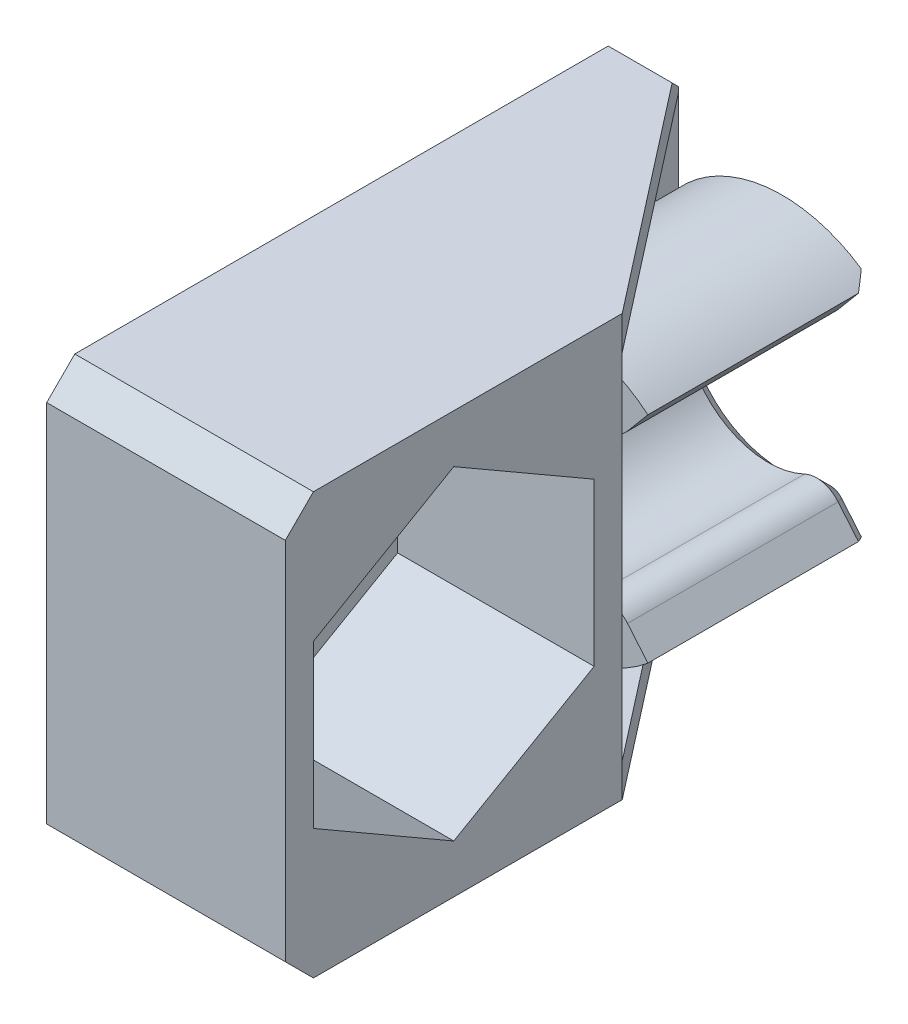
ISO-10303-21;
HEADER;
FILE_DESCRIPTION(('STEP AP214'),'2;1');
FILE_NAME('part.step','',(''),(''),'','','');
FILE_SCHEMA(('AUTOMOTIVE_DESIGN { 1 0 10303 214 1 1 1 1 }'));
ENDSEC;
DATA;
#1=APPLICATION_CONTEXT('core data for automotive mechanical design processes');
#2=APPLICATION_PROTOCOL_DEFINITION('international standard','automotive_design',2000,#1);
#3=PRODUCT_CONTEXT('',#1,'mechanical');
#4=PRODUCT('Part','Part','',(#3));
#5=PRODUCT_RELATED_PRODUCT_CATEGORY('part','',(#4));
#6=PRODUCT_DEFINITION_FORMATION('','',#4);
#7=PRODUCT_DEFINITION_CONTEXT('part definition',#1,'design');
#8=PRODUCT_DEFINITION('design','',#6,#7);
#9=PRODUCT_DEFINITION_SHAPE('','',#8);
#10=(LENGTH_UNIT() NAMED_UNIT(*) SI_UNIT(.MILLI.,.METRE.));
#11=(NAMED_UNIT(*) PLANE_ANGLE_UNIT() SI_UNIT($,.RADIAN.));
#12=(NAMED_UNIT(*) SI_UNIT($,.STERADIAN.) SOLID_ANGLE_UNIT());
#13=UNCERTAINTY_MEASURE_WITH_UNIT(LENGTH_MEASURE(1.E-05),#10,'distance_accuracy_value','');
#14=(GEOMETRIC_REPRESENTATION_CONTEXT(3) GLOBAL_UNCERTAINTY_ASSIGNED_CONTEXT((#13)) GLOBAL_UNIT_ASSIGNED_CONTEXT((#10,
#11,#12)) REPRESENTATION_CONTEXT('',''));
#15=CARTESIAN_POINT('',(0.,0.,0.));
#16=DIRECTION('',(0.,0.,1.));
#17=DIRECTION('',(1.,0.,0.));
#18=AXIS2_PLACEMENT_3D('',#15,#16,#17);
#19=CARTESIAN_POINT('',(-3.7,0.,0.));
#20=DIRECTION('',(-1.,0.,0.));
#21=DIRECTION('',(0.,0.,1.));
#22=AXIS2_PLACEMENT_3D('',#19,#20,#21);
#23=PLANE('',#22);
#24=DIRECTION('',(0.,0.,1.));
#25=VECTOR('',#24,1.);
#26=CARTESIAN_POINT('',(-3.7,-6.3,9.));
#27=LINE('',#26,#25);
#28=CARTESIAN_POINT('',(-3.7,-6.3,0.));
#29=VERTEX_POINT('',#28);
#30=CARTESIAN_POINT('',(-3.7,-6.3,9.));
#31=VERTEX_POINT('',#30);
#32=EDGE_CURVE('E229',#29,#31,#27,.T.);
#33=ORIENTED_EDGE('',*,*,#32,.F.);
#34=DIRECTION('',(0.,-1.,0.));
#35=VECTOR('',#34,1.);
#36=CARTESIAN_POINT('',(-3.7,7.5,0.));
#37=LINE('',#36,#35);
#38=CARTESIAN_POINT('',(-3.7,-3.36303434416005,0.));
#39=VERTEX_POINT('',#38);
#40=EDGE_CURVE('E246',#39,#29,#37,.T.);
#41=ORIENTED_EDGE('',*,*,#40,.F.);
#42=DIRECTION('',(0.,0.,-1.));
#43=VECTOR('',#42,1.);
#44=CARTESIAN_POINT('',(-3.7,-3.36303434416005,8.));
#45=LINE('',#44,#43);
#46=CARTESIAN_POINT('',(-3.7,-3.36303434416005,8.));
#47=VERTEX_POINT('',#46);
#48=EDGE_CURVE('E266',#39,#47,#45,.F.);
#49=ORIENTED_EDGE('',*,*,#48,.T.);
#50=DIRECTION('',(0.,-1.,0.));
#51=VECTOR('',#50,1.);
#52=CARTESIAN_POINT('',(-3.7,0.,8.));
#53=LINE('',#52,#51);
#54=CARTESIAN_POINT('',(-3.7,3.36303434416005,8.));
#55=VERTEX_POINT('',#54);
#56=EDGE_CURVE('E264',#55,#47,#53,.T.);
#57=ORIENTED_EDGE('',*,*,#56,.F.);
#58=DIRECTION('',(0.,0.,-1.));
#59=VECTOR('',#58,1.);
#60=CARTESIAN_POINT('',(-3.7,3.36303434416005,8.));
#61=LINE('',#60,#59);
#62=CARTESIAN_POINT('',(-3.7,3.36303434416005,0.));
#63=VERTEX_POINT('',#62);
#64=EDGE_CURVE('E272',#55,#63,#61,.T.);
#65=ORIENTED_EDGE('',*,*,#64,.T.);
#66=CARTESIAN_POINT('',(-3.7,6.3,0.));
#67=VERTEX_POINT('',#66);
#68=EDGE_CURVE('E255',#67,#63,#37,.T.);
#69=ORIENTED_EDGE('',*,*,#68,.F.);
#70=DIRECTION('',(0.,0.,1.));
#71=VECTOR('',#70,1.);
#72=CARTESIAN_POINT('',(-3.7,6.3,9.));
#73=LINE('',#72,#71);
#74=CARTESIAN_POINT('',(-3.7,6.3,9.));
#75=VERTEX_POINT('',#74);
#76=EDGE_CURVE('E408',#67,#75,#73,.T.);
#77=ORIENTED_EDGE('',*,*,#76,.T.);
#78=DIRECTION('',(0.,1.,0.));
#79=VECTOR('',#78,1.);
#80=CARTESIAN_POINT('',(-3.7,7.5,9.));
#81=LINE('',#80,#79);
#82=EDGE_CURVE('E248',#31,#75,#81,.T.);
#83=ORIENTED_EDGE('',*,*,#82,.F.);
#84=EDGE_LOOP('',(#33,#41,#49,#57,#65,#69,#77,#83));
#85=FACE_BOUND('',#84,.T.);
#86=ADVANCED_FACE('F34',(#85),#23,.F.);
#87=CARTESIAN_POINT('',(3.3,7.5,9.));
#88=DIRECTION('',(0.,0.,1.));
#89=DIRECTION('',(1.,0.,0.));
#90=AXIS2_PLACEMENT_3D('',#87,#88,#89);
#91=PLANE('',#90);
#92=DIRECTION('',(1.,0.,0.));
#93=VECTOR('',#92,1.);
#94=CARTESIAN_POINT('',(3.3,-6.3,9.));
#95=LINE('',#94,#93);
#96=CARTESIAN_POINT('',(3.3,-6.3,9.));
#97=VERTEX_POINT('',#96);
#98=EDGE_CURVE('E231',#31,#97,#95,.T.);
#99=ORIENTED_EDGE('',*,*,#98,.F.);
#100=ORIENTED_EDGE('',*,*,#82,.T.);
#101=DIRECTION('',(1.,0.,0.));
#102=VECTOR('',#101,1.);
#103=CARTESIAN_POINT('',(3.3,6.3,9.));
#104=LINE('',#103,#102);
#105=CARTESIAN_POINT('',(3.3,6.3,9.));
#106=VERTEX_POINT('',#105);
#107=EDGE_CURVE('E410',#75,#106,#104,.T.);
#108=ORIENTED_EDGE('',*,*,#107,.T.);
#109=DIRECTION('',(0.,1.,0.));
#110=VECTOR('',#109,1.);
#111=CARTESIAN_POINT('',(3.3,7.5,9.));
#112=LINE('',#111,#110);
#113=EDGE_CURVE('E468',#97,#106,#112,.T.);
#114=ORIENTED_EDGE('',*,*,#113,.F.);
#115=EDGE_LOOP('',(#99,#100,#108,#114));
#116=FACE_BOUND('',#115,.T.);
#117=ADVANCED_FACE('F570',(#116),#91,.F.);
#118=CARTESIAN_POINT('',(0.,0.,8.));
#119=DIRECTION('',(0.,0.,-1.));
#120=DIRECTION('',(-1.,0.,0.));
#121=AXIS2_PLACEMENT_3D('',#118,#119,#120);
#122=CYLINDRICAL_SURFACE('',#121,5.);
#123=DIRECTION('',(0.,0.,-1.));
#124=VECTOR('',#123,1.);
#125=CARTESIAN_POINT('',(3.21393804843269,3.8302222155949,8.));
#126=LINE('',#125,#124);
#127=CARTESIAN_POINT('',(3.21393804843269,3.8302222155949,8.));
#128=VERTEX_POINT('',#127);
#129=CARTESIAN_POINT('',(3.21393804843269,3.8302222155949,0.500000000000002));
#130=VERTEX_POINT('',#129);
#131=EDGE_CURVE('E300',#128,#130,#126,.T.);
#132=ORIENTED_EDGE('',*,*,#131,.T.);
#133=CARTESIAN_POINT('',(0.,0.,0.500000000000002));
#134=DIRECTION('',(-0.5416752204197,0.454519477672041,0.707106781186551));
#135=DIRECTION('',(-0.541675220419705,0.454519477672045,-0.707106781186544));
#136=AXIS2_PLACEMENT_3D('',#133,#134,#135);
#137=ELLIPSE('',#136,7.07106781186544,5.);
#138=CARTESIAN_POINT('',(2.81480576027,4.13241679068688,0.));
#139=VERTEX_POINT('',#138);
#140=EDGE_CURVE('E338',#130,#139,#137,.T.);
#141=ORIENTED_EDGE('',*,*,#140,.T.);
#142=CARTESIAN_POINT('',(0.,0.,0.));
#143=DIRECTION('',(0.,0.,1.));
#144=DIRECTION('',(1.,0.,0.));
#145=AXIS2_PLACEMENT_3D('',#142,#143,#144);
#146=CIRCLE('',#145,5.);
#147=EDGE_CURVE('E278',#139,#63,#146,.T.);
#148=ORIENTED_EDGE('',*,*,#147,.T.);
#149=ORIENTED_EDGE('',*,*,#64,.F.);
#150=CARTESIAN_POINT('',(0.,0.,8.));
#151=DIRECTION('',(0.,0.,1.));
#152=DIRECTION('',(1.,0.,0.));
#153=AXIS2_PLACEMENT_3D('',#150,#151,#152);
#154=CIRCLE('',#153,5.);
#155=EDGE_CURVE('E284',#128,#55,#154,.T.);
#156=ORIENTED_EDGE('',*,*,#155,.F.);
#157=EDGE_LOOP('',(#132,#141,#148,#149,#156));
#158=FACE_BOUND('',#157,.T.);
#159=ADVANCED_FACE('F508',(#158),#122,.T.);
#160=CARTESIAN_POINT('',(0.,0.,8.));
#161=DIRECTION('',(0.,0.,-1.));
#162=DIRECTION('',(-1.,0.,0.));
#163=AXIS2_PLACEMENT_3D('',#160,#161,#162);
#164=CYLINDRICAL_SURFACE('',#163,5.);
#165=CARTESIAN_POINT('',(0.,0.,0.));
#166=DIRECTION('',(0.,0.,1.));
#167=DIRECTION('',(1.,0.,0.));
#168=AXIS2_PLACEMENT_3D('',#165,#166,#167);
#169=CIRCLE('',#168,5.);
#170=CARTESIAN_POINT('',(2.81480576027,-4.13241679068688,0.));
#171=VERTEX_POINT('',#170);
#172=EDGE_CURVE('E254',#39,#171,#169,.T.);
#173=ORIENTED_EDGE('',*,*,#172,.T.);
#174=CARTESIAN_POINT('',(0.,0.,0.500000000000002));
#175=DIRECTION('',(-0.5416752204197,-0.454519477672041,0.707106781186551));
#176=DIRECTION('',(-0.541675220419705,-0.454519477672045,-0.707106781186544));
#177=AXIS2_PLACEMENT_3D('',#174,#175,#176);
#178=ELLIPSE('',#177,7.07106781186544,5.);
#179=CARTESIAN_POINT('',(3.21393804843269,-3.8302222155949,0.500000000000002));
#180=VERTEX_POINT('',#179);
#181=EDGE_CURVE('E334',#171,#180,#178,.T.);
#182=ORIENTED_EDGE('',*,*,#181,.T.);
#183=DIRECTION('',(0.,0.,-1.));
#184=VECTOR('',#183,1.);
#185=CARTESIAN_POINT('',(3.21393804843269,-3.8302222155949,8.));
#186=LINE('',#185,#184);
#187=CARTESIAN_POINT('',(3.21393804843269,-3.8302222155949,8.));
#188=VERTEX_POINT('',#187);
#189=EDGE_CURVE('E291',#188,#180,#186,.T.);
#190=ORIENTED_EDGE('',*,*,#189,.F.);
#191=CARTESIAN_POINT('',(0.,0.,8.));
#192=DIRECTION('',(0.,0.,1.));
#193=DIRECTION('',(1.,0.,0.));
#194=AXIS2_PLACEMENT_3D('',#191,#192,#193);
#195=CIRCLE('',#194,5.);
#196=EDGE_CURVE('E286',#47,#188,#195,.T.);
#197=ORIENTED_EDGE('',*,*,#196,.F.);
#198=ORIENTED_EDGE('',*,*,#48,.F.);
#199=EDGE_LOOP('',(#173,#182,#190,#197,#198));
#200=FACE_BOUND('',#199,.T.);
#201=ADVANCED_FACE('F538',(#200),#164,.T.);
#202=CARTESIAN_POINT('',(0.,0.,8.));
#203=DIRECTION('',(0.,0.,1.));
#204=DIRECTION('',(1.,0.,0.));
#205=AXIS2_PLACEMENT_3D('',#202,#203,#204);
#206=PLANE('',#205);
#207=DIRECTION('',(-0.642787609686538,0.766044443118979,0.));
#208=VECTOR('',#207,1.);
#209=CARTESIAN_POINT('',(1.92836282905961,-2.29813332935694,8.));
#210=LINE('',#209,#208);
#211=CARTESIAN_POINT('',(2.48950570746443,-2.96687737065454,8.));
#212=VERTEX_POINT('',#211);
#213=EDGE_CURVE('E288',#188,#212,#210,.T.);
#214=ORIENTED_EDGE('',*,*,#213,.T.);
#215=CARTESIAN_POINT('',(1.72346126434545,-3.60966498034108,8.));
#216=DIRECTION('',(0.,0.,1.));
#217=DIRECTION('',(1.,0.,0.));
#218=AXIS2_PLACEMENT_3D('',#215,#216,#217);
#219=CIRCLE('',#218,1.);
#220=CARTESIAN_POINT('',(1.29259594825909,-2.70724873525581,8.));
#221=VERTEX_POINT('',#220);
#222=EDGE_CURVE('E316',#212,#221,#219,.T.);
#223=ORIENTED_EDGE('',*,*,#222,.T.);
#224=CARTESIAN_POINT('',(0.,0.,8.));
#225=DIRECTION('',(0.,0.,-1.));
#226=DIRECTION('',(1.,0.,0.));
#227=AXIS2_PLACEMENT_3D('',#224,#225,#226);
#228=CIRCLE('',#227,3.);
#229=CARTESIAN_POINT('',(1.29259594825909,2.70724873525581,8.));
#230=VERTEX_POINT('',#229);
#231=EDGE_CURVE('E279',#221,#230,#228,.T.);
#232=ORIENTED_EDGE('',*,*,#231,.T.);
#233=CARTESIAN_POINT('',(1.72346126434546,3.60966498034108,8.));
#234=DIRECTION('',(0.,0.,1.));
#235=DIRECTION('',(1.,0.,0.));
#236=AXIS2_PLACEMENT_3D('',#233,#234,#235);
#237=CIRCLE('',#236,1.);
#238=CARTESIAN_POINT('',(2.48950570746443,2.96687737065454,8.));
#239=VERTEX_POINT('',#238);
#240=EDGE_CURVE('E314',#230,#239,#237,.T.);
#241=ORIENTED_EDGE('',*,*,#240,.T.);
#242=DIRECTION('',(0.642787609686538,0.766044443118979,0.));
#243=VECTOR('',#242,1.);
#244=CARTESIAN_POINT('',(1.92836282905961,2.29813332935694,8.));
#245=LINE('',#244,#243);
#246=EDGE_CURVE('E282',#239,#128,#245,.T.);
#247=ORIENTED_EDGE('',*,*,#246,.T.);
#248=ORIENTED_EDGE('',*,*,#155,.T.);
#249=ORIENTED_EDGE('',*,*,#56,.T.);
#250=ORIENTED_EDGE('',*,*,#196,.T.);
#251=EDGE_LOOP('',(#214,#223,#232,#241,#247,#248,#249,#250));
#252=FACE_BOUND('',#251,.T.);
#253=ADVANCED_FACE('F544',(#252),#206,.T.);
#254=CARTESIAN_POINT('',(0.,0.,8.));
#255=DIRECTION('',(0.,0.,-1.));
#256=DIRECTION('',(-1.,0.,0.));
#257=AXIS2_PLACEMENT_3D('',#254,#255,#256);
#258=CYLINDRICAL_SURFACE('',#257,3.);
#259=DIRECTION('',(0.,0.,-1.));
#260=VECTOR('',#259,1.);
#261=CARTESIAN_POINT('',(1.29259594825909,-2.70724873525581,8.));
#262=LINE('',#261,#260);
#263=CARTESIAN_POINT('',(1.29259594825909,-2.70724873525581,0.500000000000002));
#264=VERTEX_POINT('',#263);
#265=EDGE_CURVE('E309',#221,#264,#262,.T.);
#266=ORIENTED_EDGE('',*,*,#265,.T.);
#267=CARTESIAN_POINT('',(0.,0.,0.500000000000002));
#268=DIRECTION('',(0.,0.,1.));
#269=DIRECTION('',(1.,0.,0.));
#270=AXIS2_PLACEMENT_3D('',#267,#268,#269);
#271=CIRCLE('',#270,3.);
#272=CARTESIAN_POINT('',(1.29259594825909,2.70724873525581,0.500000000000002));
#273=VERTEX_POINT('',#272);
#274=EDGE_CURVE('E344',#264,#273,#271,.F.);
#275=ORIENTED_EDGE('',*,*,#274,.T.);
#276=DIRECTION('',(0.,0.,-1.));
#277=VECTOR('',#276,1.);
#278=CARTESIAN_POINT('',(1.29259594825909,2.70724873525581,8.));
#279=LINE('',#278,#277);
#280=EDGE_CURVE('E303',#273,#230,#279,.F.);
#281=ORIENTED_EDGE('',*,*,#280,.T.);
#282=ORIENTED_EDGE('',*,*,#231,.F.);
#283=EDGE_LOOP('',(#266,#275,#281,#282));
#284=FACE_BOUND('',#283,.T.);
#285=ADVANCED_FACE('F550',(#284),#258,.F.);
#286=CARTESIAN_POINT('',(1.92836282905961,2.29813332935694,8.));
#287=DIRECTION('',(-0.766044443118979,0.642787609686538,0.));
#288=DIRECTION('',(-0.642787609686538,-0.766044443118979,0.));
#289=AXIS2_PLACEMENT_3D('',#286,#287,#288);
#290=PLANE('',#289);
#291=DIRECTION('',(0.,0.,-1.));
#292=VECTOR('',#291,1.);
#293=CARTESIAN_POINT('',(2.48950570746443,2.96687737065454,8.));
#294=LINE('',#293,#292);
#295=CARTESIAN_POINT('',(2.48950570746443,2.96687737065454,0.500000000000002));
#296=VERTEX_POINT('',#295);
#297=EDGE_CURVE('E318',#239,#296,#294,.T.);
#298=ORIENTED_EDGE('',*,*,#297,.T.);
#299=DIRECTION('',(0.642787609686538,0.766044443118979,0.));
#300=VECTOR('',#299,1.);
#301=CARTESIAN_POINT('',(1.92836282905961,2.29813332935694,0.500000000000002));
#302=LINE('',#301,#300);
#303=EDGE_CURVE('E336',#296,#130,#302,.T.);
#304=ORIENTED_EDGE('',*,*,#303,.T.);
#305=ORIENTED_EDGE('',*,*,#131,.F.);
#306=ORIENTED_EDGE('',*,*,#246,.F.);
#307=EDGE_LOOP('',(#298,#304,#305,#306));
#308=FACE_BOUND('',#307,.T.);
#309=ADVANCED_FACE('F558',(#308),#290,.F.);
#310=CARTESIAN_POINT('',(-5.2,2.5,8.));
#311=DIRECTION('',(1.,0.,0.));
#312=DIRECTION('',(0.,0.,-1.));
#313=AXIS2_PLACEMENT_3D('',#310,#311,#312);
#314=PLANE('',#313);
#315=CARTESIAN_POINT('',(-5.2,0.,15.));
#316=DIRECTION('',(-1.,0.,0.));
#317=DIRECTION('',(0.,0.,1.));
#318=AXIS2_PLACEMENT_3D('',#315,#316,#317);
#319=CIRCLE('',#318,3.);
#320=CARTESIAN_POINT('',(-5.2,0.,18.));
#321=VERTEX_POINT('',#320);
#322=EDGE_CURVE('E473',#321,#321,#319,.T.);
#323=ORIENTED_EDGE('',*,*,#322,.F.);
#324=EDGE_LOOP('',(#323));
#325=FACE_BOUND('',#324,.T.);
#326=DIRECTION('',(0.,1.,0.));
#327=VECTOR('',#326,1.);
#328=CARTESIAN_POINT('',(-5.2,7.5,21.));
#329=LINE('',#328,#327);
#330=CARTESIAN_POINT('',(-5.2,-6.49999999999999,21.));
#331=VERTEX_POINT('',#330);
#332=CARTESIAN_POINT('',(-5.2,6.5,21.));
#333=VERTEX_POINT('',#332);
#334=EDGE_CURVE('E260',#331,#333,#329,.T.);
#335=ORIENTED_EDGE('',*,*,#334,.T.);
#336=DIRECTION('',(0.,-0.707106781186546,0.707106781186549));
#337=VECTOR('',#336,1.);
#338=CARTESIAN_POINT('',(-5.2,6.5,21.));
#339=LINE('',#338,#337);
#340=CARTESIAN_POINT('',(-5.2,7.5,20.));
#341=VERTEX_POINT('',#340);
#342=EDGE_CURVE('E370',#333,#341,#339,.F.);
#343=ORIENTED_EDGE('',*,*,#342,.T.);
#344=DIRECTION('',(0.,0.,-1.));
#345=VECTOR('',#344,1.);
#346=CARTESIAN_POINT('',(-5.2,7.5,0.));
#347=LINE('',#346,#345);
#348=CARTESIAN_POINT('',(-5.2,7.5,1.));
#349=VERTEX_POINT('',#348);
#350=EDGE_CURVE('E256',#341,#349,#347,.T.);
#351=ORIENTED_EDGE('',*,*,#350,.T.);
#352=DIRECTION('',(0.,-0.707106781186549,-0.707106781186546));
#353=VECTOR('',#352,1.);
#354=CARTESIAN_POINT('',(-5.2,7.5,1.));
#355=LINE('',#354,#353);
#356=CARTESIAN_POINT('',(-5.2,6.5,0.));
#357=VERTEX_POINT('',#356);
#358=EDGE_CURVE('E364',#349,#357,#355,.T.);
#359=ORIENTED_EDGE('',*,*,#358,.T.);
#360=DIRECTION('',(0.,-1.,0.));
#361=VECTOR('',#360,1.);
#362=CARTESIAN_POINT('',(-5.2,2.5,0.));
#363=LINE('',#362,#361);
#364=CARTESIAN_POINT('',(-5.2,-6.5,0.));
#365=VERTEX_POINT('',#364);
#366=EDGE_CURVE('E294',#357,#365,#363,.T.);
#367=ORIENTED_EDGE('',*,*,#366,.T.);
#368=DIRECTION('',(0.,-0.707106781186546,0.707106781186549));
#369=VECTOR('',#368,1.);
#370=CARTESIAN_POINT('',(-5.2,-6.5,0.));
#371=LINE('',#370,#369);
#372=CARTESIAN_POINT('',(-5.2,-7.5,1.));
#373=VERTEX_POINT('',#372);
#374=EDGE_CURVE('E366',#365,#373,#371,.T.);
#375=ORIENTED_EDGE('',*,*,#374,.T.);
#376=DIRECTION('',(0.,0.,1.));
#377=VECTOR('',#376,1.);
#378=CARTESIAN_POINT('',(-5.2,-7.5,0.));
#379=LINE('',#378,#377);
#380=CARTESIAN_POINT('',(-5.2,-7.5,20.));
#381=VERTEX_POINT('',#380);
#382=EDGE_CURVE('E475',#373,#381,#379,.T.);
#383=ORIENTED_EDGE('',*,*,#382,.T.);
#384=DIRECTION('',(0.,-0.707106781186549,-0.707106781186546));
#385=VECTOR('',#384,1.);
#386=CARTESIAN_POINT('',(-5.2,-7.5,20.));
#387=LINE('',#386,#385);
#388=EDGE_CURVE('E368',#381,#331,#387,.F.);
#389=ORIENTED_EDGE('',*,*,#388,.T.);
#390=EDGE_LOOP('',(#335,#343,#351,#359,#367,#375,#383,#389));
#391=FACE_BOUND('',#390,.T.);
#392=ADVANCED_FACE('F391',(#325,#391),#314,.F.);
#393=CARTESIAN_POINT('',(1.92836282905961,-2.29813332935694,8.));
#394=DIRECTION('',(-0.766044443118979,-0.642787609686538,0.));
#395=DIRECTION('',(0.642787609686538,-0.766044443118979,0.));
#396=AXIS2_PLACEMENT_3D('',#393,#394,#395);
#397=PLANE('',#396);
#398=ORIENTED_EDGE('',*,*,#189,.T.);
#399=DIRECTION('',(-0.642787609686538,0.766044443118979,0.));
#400=VECTOR('',#399,1.);
#401=CARTESIAN_POINT('',(1.92836282905961,-2.29813332935694,0.500000000000002));
#402=LINE('',#401,#400);
#403=CARTESIAN_POINT('',(2.48950570746443,-2.96687737065454,0.500000000000002));
#404=VERTEX_POINT('',#403);
#405=EDGE_CURVE('E321',#180,#404,#402,.T.);
#406=ORIENTED_EDGE('',*,*,#405,.T.);
#407=DIRECTION('',(0.,0.,-1.));
#408=VECTOR('',#407,1.);
#409=CARTESIAN_POINT('',(2.48950570746443,-2.96687737065454,8.));
#410=LINE('',#409,#408);
#411=EDGE_CURVE('E312',#404,#212,#410,.F.);
#412=ORIENTED_EDGE('',*,*,#411,.T.);
#413=ORIENTED_EDGE('',*,*,#213,.F.);
#414=EDGE_LOOP('',(#398,#406,#412,#413));
#415=FACE_BOUND('',#414,.T.);
#416=ADVANCED_FACE('F541',(#415),#397,.F.);
#417=CARTESIAN_POINT('',(0.,0.,0.));
#418=DIRECTION('',(0.,0.,1.));
#419=DIRECTION('',(1.,0.,0.));
#420=AXIS2_PLACEMENT_3D('',#417,#418,#419);
#421=PLANE('',#420);
#422=DIRECTION('',(0.,-1.,0.));
#423=VECTOR('',#422,1.);
#424=CARTESIAN_POINT('',(-3.7,-6.3,0.));
#425=LINE('',#424,#423);
#426=CARTESIAN_POINT('',(-3.7,-6.5,0.));
#427=VERTEX_POINT('',#426);
#428=EDGE_CURVE('E235',#29,#427,#425,.T.);
#429=ORIENTED_EDGE('',*,*,#428,.T.);
#430=DIRECTION('',(-1.,0.,0.));
#431=VECTOR('',#430,1.);
#432=CARTESIAN_POINT('',(-5.2,-6.5,0.));
#433=LINE('',#432,#431);
#434=EDGE_CURVE('E387',#427,#365,#433,.T.);
#435=ORIENTED_EDGE('',*,*,#434,.T.);
#436=ORIENTED_EDGE('',*,*,#366,.F.);
#437=DIRECTION('',(1.,0.,0.));
#438=VECTOR('',#437,1.);
#439=CARTESIAN_POINT('',(-3.7,6.5,0.));
#440=LINE('',#439,#438);
#441=CARTESIAN_POINT('',(-3.7,6.5,0.));
#442=VERTEX_POINT('',#441);
#443=EDGE_CURVE('E50',#357,#442,#440,.T.);
#444=ORIENTED_EDGE('',*,*,#443,.T.);
#445=EDGE_CURVE('E258',#442,#67,#37,.T.);
#446=ORIENTED_EDGE('',*,*,#445,.T.);
#447=ORIENTED_EDGE('',*,*,#68,.T.);
#448=ORIENTED_EDGE('',*,*,#147,.F.);
#449=DIRECTION('',(-0.642787609686538,-0.766044443118979,0.));
#450=VECTOR('',#449,1.);
#451=CARTESIAN_POINT('',(-0.383022221559495,0.321393804843273,0.));
#452=LINE('',#451,#450);
#453=CARTESIAN_POINT('',(2.10648348590494,3.28827117549781,0.));
#454=VERTEX_POINT('',#453);
#455=EDGE_CURVE('E330',#139,#454,#452,.T.);
#456=ORIENTED_EDGE('',*,*,#455,.T.);
#457=CARTESIAN_POINT('',(1.72346126434546,3.60966498034108,0.));
#458=DIRECTION('',(0.,0.,1.));
#459=DIRECTION('',(1.,0.,0.));
#460=AXIS2_PLACEMENT_3D('',#457,#458,#459);
#461=CIRCLE('',#460,0.499999999999994);
#462=CARTESIAN_POINT('',(1.50802860630228,3.15845685779845,0.));
#463=VERTEX_POINT('',#462);
#464=EDGE_CURVE('E326',#454,#463,#461,.F.);
#465=ORIENTED_EDGE('',*,*,#464,.T.);
#466=CARTESIAN_POINT('',(0.,0.,0.));
#467=DIRECTION('',(0.,0.,1.));
#468=DIRECTION('',(1.,0.,0.));
#469=AXIS2_PLACEMENT_3D('',#466,#467,#468);
#470=CIRCLE('',#469,3.50000000000001);
#471=CARTESIAN_POINT('',(1.50802860630228,-3.15845685779845,0.));
#472=VERTEX_POINT('',#471);
#473=EDGE_CURVE('E324',#463,#472,#470,.T.);
#474=ORIENTED_EDGE('',*,*,#473,.T.);
#475=CARTESIAN_POINT('',(1.72346126434545,-3.60966498034108,0.));
#476=DIRECTION('',(0.,0.,1.));
#477=DIRECTION('',(1.,0.,0.));
#478=AXIS2_PLACEMENT_3D('',#475,#476,#477);
#479=CIRCLE('',#478,0.499999999999994);
#480=CARTESIAN_POINT('',(2.10648348590494,-3.28827117549781,0.));
#481=VERTEX_POINT('',#480);
#482=EDGE_CURVE('E328',#472,#481,#479,.F.);
#483=ORIENTED_EDGE('',*,*,#482,.T.);
#484=DIRECTION('',(0.642787609686538,-0.766044443118979,0.));
#485=VECTOR('',#484,1.);
#486=CARTESIAN_POINT('',(-0.383022221559495,-0.321393804843273,0.));
#487=LINE('',#486,#485);
#488=EDGE_CURVE('E332',#481,#171,#487,.T.);
#489=ORIENTED_EDGE('',*,*,#488,.T.);
#490=ORIENTED_EDGE('',*,*,#172,.F.);
#491=ORIENTED_EDGE('',*,*,#40,.T.);
#492=EDGE_LOOP('',(#429,#435,#436,#444,#446,#447,#448,#456,#465,#474,#483,#489,#490,#491));
#493=FACE_BOUND('',#492,.T.);
#494=ADVANCED_FACE('F252',(#493),#421,.F.);
#495=CARTESIAN_POINT('',(-3.7,7.5,0.));
#496=DIRECTION('',(0.,1.,0.));
#497=DIRECTION('',(0.,0.,1.));
#498=AXIS2_PLACEMENT_3D('',#495,#496,#497);
#499=PLANE('',#498);
#500=ORIENTED_EDGE('',*,*,#350,.F.);
#501=DIRECTION('',(1.,0.,0.));
#502=VECTOR('',#501,1.);
#503=CARTESIAN_POINT('',(-3.7,7.5,20.));
#504=LINE('',#503,#502);
#505=CARTESIAN_POINT('',(3.3,7.5,20.));
#506=VERTEX_POINT('',#505);
#507=EDGE_CURVE('E375',#341,#506,#504,.T.);
#508=ORIENTED_EDGE('',*,*,#507,.T.);
#509=DIRECTION('',(0.,0.,1.));
#510=VECTOR('',#509,1.);
#511=CARTESIAN_POINT('',(3.3,7.5,21.));
#512=LINE('',#511,#510);
#513=CARTESIAN_POINT('',(3.3,7.5,9.));
#514=VERTEX_POINT('',#513);
#515=EDGE_CURVE('E404',#514,#506,#512,.T.);
#516=ORIENTED_EDGE('',*,*,#515,.F.);
#517=DIRECTION('',(-0.613940613514921,0.,-0.789352217376326));
#518=VECTOR('',#517,1.);
#519=CARTESIAN_POINT('',(-3.7,7.5,0.));
#520=LINE('',#519,#518);
#521=CARTESIAN_POINT('',(-2.92222222222222,7.5,1.));
#522=VERTEX_POINT('',#521);
#523=EDGE_CURVE('E240',#514,#522,#520,.T.);
#524=ORIENTED_EDGE('',*,*,#523,.T.);
#525=DIRECTION('',(-1.,0.,0.));
#526=VECTOR('',#525,1.);
#527=CARTESIAN_POINT('',(-5.2,7.5,1.));
#528=LINE('',#527,#526);
#529=EDGE_CURVE('E372',#522,#349,#528,.T.);
#530=ORIENTED_EDGE('',*,*,#529,.T.);
#531=EDGE_LOOP('',(#500,#508,#516,#524,#530));
#532=FACE_BOUND('',#531,.T.);
#533=ADVANCED_FACE('F400',(#532),#499,.T.);
#534=CARTESIAN_POINT('',(-3.7,7.5,21.));
#535=DIRECTION('',(0.,0.,1.));
#536=DIRECTION('',(1.,0.,0.));
#537=AXIS2_PLACEMENT_3D('',#534,#535,#536);
#538=PLANE('',#537);
#539=DIRECTION('',(0.,-1.,0.));
#540=VECTOR('',#539,1.);
#541=CARTESIAN_POINT('',(3.3,7.5,21.));
#542=LINE('',#541,#540);
#543=CARTESIAN_POINT('',(3.3,6.5,21.));
#544=VERTEX_POINT('',#543);
#545=CARTESIAN_POINT('',(3.3,-6.49999999999999,21.));
#546=VERTEX_POINT('',#545);
#547=EDGE_CURVE('E463',#544,#546,#542,.T.);
#548=ORIENTED_EDGE('',*,*,#547,.F.);
#549=DIRECTION('',(-1.,0.,0.));
#550=VECTOR('',#549,1.);
#551=CARTESIAN_POINT('',(-3.7,6.5,21.));
#552=LINE('',#551,#550);
#553=EDGE_CURVE('E361',#544,#333,#552,.T.);
#554=ORIENTED_EDGE('',*,*,#553,.T.);
#555=ORIENTED_EDGE('',*,*,#334,.F.);
#556=DIRECTION('',(1.,0.,0.));
#557=VECTOR('',#556,1.);
#558=CARTESIAN_POINT('',(-3.7,-6.49999999999999,21.));
#559=LINE('',#558,#557);
#560=EDGE_CURVE('E346',#331,#546,#559,.T.);
#561=ORIENTED_EDGE('',*,*,#560,.T.);
#562=EDGE_LOOP('',(#548,#554,#555,#561));
#563=FACE_BOUND('',#562,.T.);
#564=ADVANCED_FACE('F482',(#563),#538,.T.);
#565=CARTESIAN_POINT('',(-3.7,-7.5,0.));
#566=DIRECTION('',(0.,-1.,0.));
#567=DIRECTION('',(0.,0.,-1.));
#568=AXIS2_PLACEMENT_3D('',#565,#566,#567);
#569=PLANE('',#568);
#570=DIRECTION('',(0.,0.,-1.));
#571=VECTOR('',#570,1.);
#572=CARTESIAN_POINT('',(3.3,-7.5,21.));
#573=LINE('',#572,#571);
#574=CARTESIAN_POINT('',(3.3,-7.5,20.));
#575=VERTEX_POINT('',#574);
#576=CARTESIAN_POINT('',(3.3,-7.5,9.));
#577=VERTEX_POINT('',#576);
#578=EDGE_CURVE('E466',#575,#577,#573,.T.);
#579=ORIENTED_EDGE('',*,*,#578,.F.);
#580=DIRECTION('',(-1.,0.,0.));
#581=VECTOR('',#580,1.);
#582=CARTESIAN_POINT('',(-3.7,-7.5,20.));
#583=LINE('',#582,#581);
#584=EDGE_CURVE('E383',#575,#381,#583,.T.);
#585=ORIENTED_EDGE('',*,*,#584,.T.);
#586=ORIENTED_EDGE('',*,*,#382,.F.);
#587=DIRECTION('',(1.,0.,0.));
#588=VECTOR('',#587,1.);
#589=CARTESIAN_POINT('',(-3.7,-7.5,1.));
#590=LINE('',#589,#588);
#591=CARTESIAN_POINT('',(-2.92222222222222,-7.5,1.));
#592=VERTEX_POINT('',#591);
#593=EDGE_CURVE('E381',#373,#592,#590,.T.);
#594=ORIENTED_EDGE('',*,*,#593,.T.);
#595=DIRECTION('',(-0.613940613514921,0.,-0.789352217376326));
#596=VECTOR('',#595,1.);
#597=CARTESIAN_POINT('',(-3.7,-7.5,0.));
#598=LINE('',#597,#596);
#599=EDGE_CURVE('E249',#577,#592,#598,.T.);
#600=ORIENTED_EDGE('',*,*,#599,.F.);
#601=EDGE_LOOP('',(#579,#585,#586,#594,#600));
#602=FACE_BOUND('',#601,.T.);
#603=ADVANCED_FACE('F493',(#602),#569,.T.);
#604=CARTESIAN_POINT('',(3.21393804843269,0.,15.));
#605=DIRECTION('',(-1.,0.,0.));
#606=DIRECTION('',(0.,0.,1.));
#607=AXIS2_PLACEMENT_3D('',#604,#605,#606);
#608=CYLINDRICAL_SURFACE('',#607,3.);
#609=ORIENTED_EDGE('',*,*,#322,.T.);
#610=EDGE_LOOP('',(#609));
#611=FACE_BOUND('',#610,.T.);
#612=CARTESIAN_POINT('',(-3.7,0.,15.));
#613=DIRECTION('',(-1.,0.,0.));
#614=DIRECTION('',(0.,0.,1.));
#615=AXIS2_PLACEMENT_3D('',#612,#613,#614);
#616=CIRCLE('',#615,3.);
#617=CARTESIAN_POINT('',(-3.7,0.,18.));
#618=VERTEX_POINT('',#617);
#619=EDGE_CURVE('E304',#618,#618,#616,.T.);
#620=ORIENTED_EDGE('',*,*,#619,.F.);
#621=EDGE_LOOP('',(#620));
#622=FACE_BOUND('',#621,.T.);
#623=ADVANCED_FACE('F578',(#611,#622),#608,.F.);
#624=CARTESIAN_POINT('',(3.3,0.,0.));
#625=DIRECTION('',(1.,0.,0.));
#626=DIRECTION('',(0.,0.,-1.));
#627=AXIS2_PLACEMENT_3D('',#624,#625,#626);
#628=PLANE('',#627);
#629=DIRECTION('',(0.,1.,0.));
#630=VECTOR('',#629,1.);
#631=CARTESIAN_POINT('',(3.3,-2.88675134594813,10.));
#632=LINE('',#631,#630);
#633=CARTESIAN_POINT('',(3.3,-2.88675134594813,10.));
#634=VERTEX_POINT('',#633);
#635=CARTESIAN_POINT('',(3.3,2.88675134594813,10.));
#636=VERTEX_POINT('',#635);
#637=EDGE_CURVE('E429',#634,#636,#632,.T.);
#638=ORIENTED_EDGE('',*,*,#637,.F.);
#639=DIRECTION('',(0.,0.5,-0.866025403784438));
#640=VECTOR('',#639,1.);
#641=CARTESIAN_POINT('',(3.3,-5.77350269189626,15.));
#642=LINE('',#641,#640);
#643=CARTESIAN_POINT('',(3.3,-5.77350269189626,15.));
#644=VERTEX_POINT('',#643);
#645=EDGE_CURVE('E359',#644,#634,#642,.T.);
#646=ORIENTED_EDGE('',*,*,#645,.F.);
#647=DIRECTION('',(0.,-0.5,-0.866025403784439));
#648=VECTOR('',#647,1.);
#649=CARTESIAN_POINT('',(3.3,-2.88675134594813,20.));
#650=LINE('',#649,#648);
#651=CARTESIAN_POINT('',(3.3,-2.88675134594813,20.));
#652=VERTEX_POINT('',#651);
#653=EDGE_CURVE('E417',#652,#644,#650,.T.);
#654=ORIENTED_EDGE('',*,*,#653,.F.);
#655=DIRECTION('',(0.,-1.,0.));
#656=VECTOR('',#655,1.);
#657=CARTESIAN_POINT('',(3.3,2.88675134594813,20.));
#658=LINE('',#657,#656);
#659=CARTESIAN_POINT('',(3.3,2.88675134594813,20.));
#660=VERTEX_POINT('',#659);
#661=EDGE_CURVE('E420',#660,#652,#658,.T.);
#662=ORIENTED_EDGE('',*,*,#661,.F.);
#663=DIRECTION('',(0.,-0.5,0.866025403784438));
#664=VECTOR('',#663,1.);
#665=CARTESIAN_POINT('',(3.3,5.77350269189626,15.));
#666=LINE('',#665,#664);
#667=CARTESIAN_POINT('',(3.3,5.77350269189626,15.));
#668=VERTEX_POINT('',#667);
#669=EDGE_CURVE('E423',#668,#660,#666,.T.);
#670=ORIENTED_EDGE('',*,*,#669,.F.);
#671=DIRECTION('',(0.,0.5,0.866025403784439));
#672=VECTOR('',#671,1.);
#673=CARTESIAN_POINT('',(3.3,2.88675134594813,10.));
#674=LINE('',#673,#672);
#675=EDGE_CURVE('E426',#636,#668,#674,.T.);
#676=ORIENTED_EDGE('',*,*,#675,.F.);
#677=EDGE_LOOP('',(#638,#646,#654,#662,#670,#676));
#678=FACE_BOUND('',#677,.T.);
#679=ORIENTED_EDGE('',*,*,#515,.T.);
#680=DIRECTION('',(0.,0.707106781186546,-0.707106781186549));
#681=VECTOR('',#680,1.);
#682=CARTESIAN_POINT('',(3.3,13.75,13.75));
#683=LINE('',#682,#681);
#684=EDGE_CURVE('E379',#506,#544,#683,.F.);
#685=ORIENTED_EDGE('',*,*,#684,.T.);
#686=ORIENTED_EDGE('',*,*,#547,.T.);
#687=DIRECTION('',(0.,0.707106781186549,0.707106781186546));
#688=VECTOR('',#687,1.);
#689=CARTESIAN_POINT('',(3.3,-13.75,13.75));
#690=LINE('',#689,#688);
#691=EDGE_CURVE('E377',#546,#575,#690,.F.);
#692=ORIENTED_EDGE('',*,*,#691,.T.);
#693=ORIENTED_EDGE('',*,*,#578,.T.);
#694=EDGE_CURVE('E469',#577,#97,#112,.T.);
#695=ORIENTED_EDGE('',*,*,#694,.T.);
#696=ORIENTED_EDGE('',*,*,#113,.T.);
#697=DIRECTION('',(0.,1.,0.));
#698=VECTOR('',#697,1.);
#699=CARTESIAN_POINT('',(3.3,6.3,9.));
#700=LINE('',#699,#698);
#701=EDGE_CURVE('E350',#106,#514,#700,.T.);
#702=ORIENTED_EDGE('',*,*,#701,.T.);
#703=EDGE_LOOP('',(#679,#685,#686,#692,#693,#695,#696,#702));
#704=FACE_BOUND('',#703,.T.);
#705=ADVANCED_FACE('F490',(#678,#704),#628,.T.);
#706=CARTESIAN_POINT('',(-3.7,0.,0.));
#707=DIRECTION('',(-1.,0.,0.));
#708=DIRECTION('',(0.,0.,1.));
#709=AXIS2_PLACEMENT_3D('',#706,#707,#708);
#710=PLANE('',#709);
#711=ORIENTED_EDGE('',*,*,#619,.T.);
#712=EDGE_LOOP('',(#711));
#713=FACE_BOUND('',#712,.T.);
#714=DIRECTION('',(0.,0.5,-0.866025403784439));
#715=VECTOR('',#714,1.);
#716=CARTESIAN_POINT('',(-3.7,-5.77350269189626,15.));
#717=LINE('',#716,#715);
#718=CARTESIAN_POINT('',(-3.7,-5.77350269189626,15.));
#719=VERTEX_POINT('',#718);
#720=CARTESIAN_POINT('',(-3.7,-2.88675134594813,10.));
#721=VERTEX_POINT('',#720);
#722=EDGE_CURVE('E437',#719,#721,#717,.T.);
#723=ORIENTED_EDGE('',*,*,#722,.T.);
#724=DIRECTION('',(0.,1.,0.));
#725=VECTOR('',#724,1.);
#726=CARTESIAN_POINT('',(-3.7,-2.88675134594813,10.));
#727=LINE('',#726,#725);
#728=CARTESIAN_POINT('',(-3.7,2.88675134594813,10.));
#729=VERTEX_POINT('',#728);
#730=EDGE_CURVE('E419',#721,#729,#727,.T.);
#731=ORIENTED_EDGE('',*,*,#730,.T.);
#732=DIRECTION('',(0.,0.5,0.866025403784439));
#733=VECTOR('',#732,1.);
#734=CARTESIAN_POINT('',(-3.7,2.88675134594813,10.));
#735=LINE('',#734,#733);
#736=CARTESIAN_POINT('',(-3.7,5.77350269189626,15.));
#737=VERTEX_POINT('',#736);
#738=EDGE_CURVE('E453',#729,#737,#735,.T.);
#739=ORIENTED_EDGE('',*,*,#738,.T.);
#740=DIRECTION('',(0.,-0.5,0.866025403784438));
#741=VECTOR('',#740,1.);
#742=CARTESIAN_POINT('',(-3.7,5.77350269189626,15.));
#743=LINE('',#742,#741);
#744=CARTESIAN_POINT('',(-3.7,2.88675134594813,20.));
#745=VERTEX_POINT('',#744);
#746=EDGE_CURVE('E449',#737,#745,#743,.T.);
#747=ORIENTED_EDGE('',*,*,#746,.T.);
#748=DIRECTION('',(0.,-1.,0.));
#749=VECTOR('',#748,1.);
#750=CARTESIAN_POINT('',(-3.7,2.88675134594813,20.));
#751=LINE('',#750,#749);
#752=CARTESIAN_POINT('',(-3.7,-2.88675134594813,20.));
#753=VERTEX_POINT('',#752);
#754=EDGE_CURVE('E445',#745,#753,#751,.T.);
#755=ORIENTED_EDGE('',*,*,#754,.T.);
#756=DIRECTION('',(0.,-0.5,-0.866025403784439));
#757=VECTOR('',#756,1.);
#758=CARTESIAN_POINT('',(-3.7,-2.88675134594813,20.));
#759=LINE('',#758,#757);
#760=EDGE_CURVE('E441',#753,#719,#759,.T.);
#761=ORIENTED_EDGE('',*,*,#760,.T.);
#762=EDGE_LOOP('',(#723,#731,#739,#747,#755,#761));
#763=FACE_BOUND('',#762,.T.);
#764=ADVANCED_FACE('F757',(#713,#763),#710,.F.);
#765=CARTESIAN_POINT('',(-18.9752523165195,-2.88675134594813,10.));
#766=DIRECTION('',(0.,0.,-1.));
#767=DIRECTION('',(0.,1.,0.));
#768=AXIS2_PLACEMENT_3D('',#765,#766,#767);
#769=PLANE('',#768);
#770=DIRECTION('',(1.,0.,0.));
#771=VECTOR('',#770,1.);
#772=CARTESIAN_POINT('',(-18.9752523165195,-2.88675134594813,10.));
#773=LINE('',#772,#771);
#774=EDGE_CURVE('E307',#721,#634,#773,.T.);
#775=ORIENTED_EDGE('',*,*,#774,.T.);
#776=ORIENTED_EDGE('',*,*,#637,.T.);
#777=DIRECTION('',(1.,0.,0.));
#778=VECTOR('',#777,1.);
#779=CARTESIAN_POINT('',(-18.9752523165195,2.88675134594813,10.));
#780=LINE('',#779,#778);
#781=EDGE_CURVE('E436',#729,#636,#780,.T.);
#782=ORIENTED_EDGE('',*,*,#781,.F.);
#783=ORIENTED_EDGE('',*,*,#730,.F.);
#784=EDGE_LOOP('',(#775,#776,#782,#783));
#785=FACE_BOUND('',#784,.T.);
#786=ADVANCED_FACE('F851',(#785),#769,.F.);
#787=CARTESIAN_POINT('',(-18.9752523165195,2.88675134594813,10.));
#788=DIRECTION('',(0.,0.866025403784439,-0.5));
#789=DIRECTION('',(0.,0.5,0.866025403784439));
#790=AXIS2_PLACEMENT_3D('',#787,#788,#789);
#791=PLANE('',#790);
#792=ORIENTED_EDGE('',*,*,#781,.T.);
#793=ORIENTED_EDGE('',*,*,#675,.T.);
#794=DIRECTION('',(1.,0.,0.));
#795=VECTOR('',#794,1.);
#796=CARTESIAN_POINT('',(-18.9752523165195,5.77350269189626,15.));
#797=LINE('',#796,#795);
#798=EDGE_CURVE('E452',#737,#668,#797,.T.);
#799=ORIENTED_EDGE('',*,*,#798,.F.);
#800=ORIENTED_EDGE('',*,*,#738,.F.);
#801=EDGE_LOOP('',(#792,#793,#799,#800));
#802=FACE_BOUND('',#801,.T.);
#803=ADVANCED_FACE('F847',(#802),#791,.F.);
#804=CARTESIAN_POINT('',(-18.9752523165195,5.77350269189626,15.));
#805=DIRECTION('',(0.,0.866025403784438,0.5));
#806=DIRECTION('',(0.,-0.5,0.866025403784438));
#807=AXIS2_PLACEMENT_3D('',#804,#805,#806);
#808=PLANE('',#807);
#809=ORIENTED_EDGE('',*,*,#798,.T.);
#810=ORIENTED_EDGE('',*,*,#669,.T.);
#811=DIRECTION('',(1.,0.,0.));
#812=VECTOR('',#811,1.);
#813=CARTESIAN_POINT('',(-18.9752523165195,2.88675134594813,20.));
#814=LINE('',#813,#812);
#815=EDGE_CURVE('E448',#745,#660,#814,.T.);
#816=ORIENTED_EDGE('',*,*,#815,.F.);
#817=ORIENTED_EDGE('',*,*,#746,.F.);
#818=EDGE_LOOP('',(#809,#810,#816,#817));
#819=FACE_BOUND('',#818,.T.);
#820=ADVANCED_FACE('F843',(#819),#808,.F.);
#821=CARTESIAN_POINT('',(-18.9752523165195,2.88675134594813,20.));
#822=DIRECTION('',(0.,0.,1.));
#823=DIRECTION('',(1.,0.,0.));
#824=AXIS2_PLACEMENT_3D('',#821,#822,#823);
#825=PLANE('',#824);
#826=ORIENTED_EDGE('',*,*,#815,.T.);
#827=ORIENTED_EDGE('',*,*,#661,.T.);
#828=DIRECTION('',(1.,0.,0.));
#829=VECTOR('',#828,1.);
#830=CARTESIAN_POINT('',(-18.9752523165195,-2.88675134594813,20.));
#831=LINE('',#830,#829);
#832=EDGE_CURVE('E444',#753,#652,#831,.T.);
#833=ORIENTED_EDGE('',*,*,#832,.F.);
#834=ORIENTED_EDGE('',*,*,#754,.F.);
#835=EDGE_LOOP('',(#826,#827,#833,#834));
#836=FACE_BOUND('',#835,.T.);
#837=ADVANCED_FACE('F839',(#836),#825,.F.);
#838=CARTESIAN_POINT('',(-18.9752523165195,-2.88675134594813,20.));
#839=DIRECTION('',(0.,-0.866025403784438,0.5));
#840=DIRECTION('',(0.,-0.5,-0.866025403784439));
#841=AXIS2_PLACEMENT_3D('',#838,#839,#840);
#842=PLANE('',#841);
#843=ORIENTED_EDGE('',*,*,#832,.T.);
#844=ORIENTED_EDGE('',*,*,#653,.T.);
#845=DIRECTION('',(1.,0.,0.));
#846=VECTOR('',#845,1.);
#847=CARTESIAN_POINT('',(-18.9752523165195,-5.77350269189626,15.));
#848=LINE('',#847,#846);
#849=EDGE_CURVE('E440',#719,#644,#848,.T.);
#850=ORIENTED_EDGE('',*,*,#849,.F.);
#851=ORIENTED_EDGE('',*,*,#760,.F.);
#852=EDGE_LOOP('',(#843,#844,#850,#851));
#853=FACE_BOUND('',#852,.T.);
#854=ADVANCED_FACE('F835',(#853),#842,.F.);
#855=CARTESIAN_POINT('',(-18.9752523165195,-5.77350269189626,15.));
#856=DIRECTION('',(0.,-0.866025403784438,-0.5));
#857=DIRECTION('',(0.,0.5,-0.866025403784439));
#858=AXIS2_PLACEMENT_3D('',#855,#856,#857);
#859=PLANE('',#858);
#860=ORIENTED_EDGE('',*,*,#849,.T.);
#861=ORIENTED_EDGE('',*,*,#645,.T.);
#862=ORIENTED_EDGE('',*,*,#774,.F.);
#863=ORIENTED_EDGE('',*,*,#722,.F.);
#864=EDGE_LOOP('',(#860,#861,#862,#863));
#865=FACE_BOUND('',#864,.T.);
#866=ADVANCED_FACE('F631',(#865),#859,.F.);
#867=CARTESIAN_POINT('',(1.72346126434545,-3.60966498034108,8.));
#868=DIRECTION('',(0.,0.,-1.));
#869=DIRECTION('',(-1.,0.,0.));
#870=AXIS2_PLACEMENT_3D('',#867,#868,#869);
#871=CYLINDRICAL_SURFACE('',#870,1.);
#872=ORIENTED_EDGE('',*,*,#411,.F.);
#873=CARTESIAN_POINT('',(1.72346126434545,-3.60966498034108,0.500000000000002));
#874=DIRECTION('',(0.,0.,1.));
#875=DIRECTION('',(1.,0.,0.));
#876=AXIS2_PLACEMENT_3D('',#873,#874,#875);
#877=CIRCLE('',#876,1.);
#878=EDGE_CURVE('E340',#404,#264,#877,.T.);
#879=ORIENTED_EDGE('',*,*,#878,.T.);
#880=ORIENTED_EDGE('',*,*,#265,.F.);
#881=ORIENTED_EDGE('',*,*,#222,.F.);
#882=EDGE_LOOP('',(#872,#879,#880,#881));
#883=FACE_BOUND('',#882,.T.);
#884=ADVANCED_FACE('F548',(#883),#871,.T.);
#885=CARTESIAN_POINT('',(1.72346126434546,3.60966498034108,8.));
#886=DIRECTION('',(0.,0.,-1.));
#887=DIRECTION('',(-1.,0.,0.));
#888=AXIS2_PLACEMENT_3D('',#885,#886,#887);
#889=CYLINDRICAL_SURFACE('',#888,1.);
#890=ORIENTED_EDGE('',*,*,#280,.F.);
#891=CARTESIAN_POINT('',(1.72346126434546,3.60966498034108,0.500000000000002));
#892=DIRECTION('',(0.,0.,1.));
#893=DIRECTION('',(1.,0.,0.));
#894=AXIS2_PLACEMENT_3D('',#891,#892,#893);
#895=CIRCLE('',#894,1.);
#896=EDGE_CURVE('E342',#273,#296,#895,.T.);
#897=ORIENTED_EDGE('',*,*,#896,.T.);
#898=ORIENTED_EDGE('',*,*,#297,.F.);
#899=ORIENTED_EDGE('',*,*,#240,.F.);
#900=EDGE_LOOP('',(#890,#897,#898,#899));
#901=FACE_BOUND('',#900,.T.);
#902=ADVANCED_FACE('F556',(#901),#889,.T.);
#903=CARTESIAN_POINT('',(1.92836282905961,2.29813332935694,0.500000000000002));
#904=DIRECTION('',(-0.5416752204197,0.454519477672041,0.707106781186551));
#905=DIRECTION('',(0.642787609686538,0.766044443118979,0.));
#906=AXIS2_PLACEMENT_3D('',#903,#904,#905);
#907=PLANE('',#906);
#908=ORIENTED_EDGE('',*,*,#140,.F.);
#909=ORIENTED_EDGE('',*,*,#303,.F.);
#910=DIRECTION('',(0.541675220419705,-0.454519477672045,0.707106781186544));
#911=VECTOR('',#910,1.);
#912=CARTESIAN_POINT('',(2.10648348590494,3.28827117549781,0.));
#913=LINE('',#912,#911);
#914=EDGE_CURVE('E356',#454,#296,#913,.T.);
#915=ORIENTED_EDGE('',*,*,#914,.F.);
#916=ORIENTED_EDGE('',*,*,#455,.F.);
#917=EDGE_LOOP('',(#908,#909,#915,#916));
#918=FACE_BOUND('',#917,.T.);
#919=ADVANCED_FACE('F514',(#918),#907,.F.);
#920=CARTESIAN_POINT('',(1.72346126434546,3.60966498034108,0.));
#921=DIRECTION('',(0.,0.,1.));
#922=DIRECTION('',(1.,0.,0.));
#923=AXIS2_PLACEMENT_3D('',#920,#921,#922);
#924=CONICAL_SURFACE('',#923,0.499999999999994,0.785398163397452);
#925=ORIENTED_EDGE('',*,*,#914,.T.);
#926=ORIENTED_EDGE('',*,*,#896,.F.);
#927=DIRECTION('',(-0.304667786782754,-0.638104646352698,0.707106781186544));
#928=VECTOR('',#927,1.);
#929=CARTESIAN_POINT('',(1.50802860630228,3.15845685779845,0.));
#930=LINE('',#929,#928);
#931=EDGE_CURVE('E353',#463,#273,#930,.T.);
#932=ORIENTED_EDGE('',*,*,#931,.F.);
#933=ORIENTED_EDGE('',*,*,#464,.F.);
#934=EDGE_LOOP('',(#925,#926,#932,#933));
#935=FACE_BOUND('',#934,.T.);
#936=ADVANCED_FACE('F522',(#935),#924,.T.);
#937=CARTESIAN_POINT('',(0.,0.,0.500000000000002));
#938=DIRECTION('',(0.,0.,-1.));
#939=DIRECTION('',(-1.,0.,0.));
#940=AXIS2_PLACEMENT_3D('',#937,#938,#939);
#941=CONICAL_SURFACE('',#940,3.,0.785398163397453);
#942=ORIENTED_EDGE('',*,*,#931,.T.);
#943=ORIENTED_EDGE('',*,*,#274,.F.);
#944=DIRECTION('',(-0.304667786782754,0.638104646352698,0.707106781186544));
#945=VECTOR('',#944,1.);
#946=CARTESIAN_POINT('',(1.50802860630228,-3.15845685779845,0.));
#947=LINE('',#946,#945);
#948=EDGE_CURVE('E349',#472,#264,#947,.T.);
#949=ORIENTED_EDGE('',*,*,#948,.F.);
#950=ORIENTED_EDGE('',*,*,#473,.F.);
#951=EDGE_LOOP('',(#942,#943,#949,#950));
#952=FACE_BOUND('',#951,.T.);
#953=ADVANCED_FACE('F525',(#952),#941,.F.);
#954=CARTESIAN_POINT('',(1.72346126434545,-3.60966498034108,0.));
#955=DIRECTION('',(0.,0.,1.));
#956=DIRECTION('',(1.,0.,0.));
#957=AXIS2_PLACEMENT_3D('',#954,#955,#956);
#958=CONICAL_SURFACE('',#957,0.499999999999994,0.785398163397452);
#959=ORIENTED_EDGE('',*,*,#948,.T.);
#960=ORIENTED_EDGE('',*,*,#878,.F.);
#961=DIRECTION('',(0.541675220419705,0.454519477672044,0.707106781186545));
#962=VECTOR('',#961,1.);
#963=CARTESIAN_POINT('',(2.10648348590494,-3.28827117549781,0.));
#964=LINE('',#963,#962);
#965=EDGE_CURVE('E347',#481,#404,#964,.T.);
#966=ORIENTED_EDGE('',*,*,#965,.F.);
#967=ORIENTED_EDGE('',*,*,#482,.F.);
#968=EDGE_LOOP('',(#959,#960,#966,#967));
#969=FACE_BOUND('',#968,.T.);
#970=ADVANCED_FACE('F530',(#969),#958,.T.);
#971=CARTESIAN_POINT('',(1.92836282905961,-2.29813332935694,0.500000000000002));
#972=DIRECTION('',(-0.5416752204197,-0.454519477672041,0.707106781186551));
#973=DIRECTION('',(-0.642787609686538,0.766044443118979,0.));
#974=AXIS2_PLACEMENT_3D('',#971,#972,#973);
#975=PLANE('',#974);
#976=ORIENTED_EDGE('',*,*,#181,.F.);
#977=ORIENTED_EDGE('',*,*,#488,.F.);
#978=ORIENTED_EDGE('',*,*,#965,.T.);
#979=ORIENTED_EDGE('',*,*,#405,.F.);
#980=EDGE_LOOP('',(#976,#977,#978,#979));
#981=FACE_BOUND('',#980,.T.);
#982=ADVANCED_FACE('F534',(#981),#975,.F.);
#983=CARTESIAN_POINT('',(-3.7,6.3,0.));
#984=DIRECTION('',(0.789352217376326,0.,-0.613940613514921));
#985=DIRECTION('',(-0.613940613514921,0.,-0.789352217376326));
#986=AXIS2_PLACEMENT_3D('',#983,#984,#985);
#987=PLANE('',#986);
#988=ORIENTED_EDGE('',*,*,#445,.F.);
#989=DIRECTION('',(0.48189987357506,0.619585551739364,0.619585551739362));
#990=VECTOR('',#989,1.);
#991=CARTESIAN_POINT('',(-3.75971563981043,6.42322274881516,-0.0767772511848323));
#992=LINE('',#991,#990);
#993=EDGE_CURVE('E11',#442,#522,#992,.T.);
#994=ORIENTED_EDGE('',*,*,#993,.T.);
#995=ORIENTED_EDGE('',*,*,#523,.F.);
#996=ORIENTED_EDGE('',*,*,#701,.F.);
#997=DIRECTION('',(-0.613940613514921,0.,-0.789352217376326));
#998=VECTOR('',#997,1.);
#999=CARTESIAN_POINT('',(-3.7,6.3,0.));
#1000=LINE('',#999,#998);
#1001=EDGE_CURVE('E414',#106,#67,#1000,.T.);
#1002=ORIENTED_EDGE('',*,*,#1001,.T.);
#1003=EDGE_LOOP('',(#988,#994,#995,#996,#1002));
#1004=FACE_BOUND('',#1003,.T.);
#1005=ADVANCED_FACE('F503',(#1004),#987,.T.);
#1006=CARTESIAN_POINT('',(0.,6.3,0.));
#1007=DIRECTION('',(0.,1.,0.));
#1008=DIRECTION('',(0.,0.,1.));
#1009=AXIS2_PLACEMENT_3D('',#1006,#1007,#1008);
#1010=PLANE('',#1009);
#1011=ORIENTED_EDGE('',*,*,#76,.F.);
#1012=ORIENTED_EDGE('',*,*,#1001,.F.);
#1013=ORIENTED_EDGE('',*,*,#107,.F.);
#1014=EDGE_LOOP('',(#1011,#1012,#1013));
#1015=FACE_BOUND('',#1014,.T.);
#1016=ADVANCED_FACE('F688',(#1015),#1010,.F.);
#1017=CARTESIAN_POINT('',(-3.7,-6.3,0.));
#1018=DIRECTION('',(-0.789352217376326,0.,0.613940613514921));
#1019=DIRECTION('',(0.613940613514921,0.,0.789352217376326));
#1020=AXIS2_PLACEMENT_3D('',#1017,#1018,#1019);
#1021=PLANE('',#1020);
#1022=ORIENTED_EDGE('',*,*,#599,.T.);
#1023=DIRECTION('',(-0.481899873575061,0.619585551739361,-0.619585551739363));
#1024=VECTOR('',#1023,1.);
#1025=CARTESIAN_POINT('',(-2.84075829383886,-7.60473933649289,1.10473933649289));
#1026=LINE('',#1025,#1024);
#1027=EDGE_CURVE('E43',#592,#427,#1026,.T.);
#1028=ORIENTED_EDGE('',*,*,#1027,.T.);
#1029=ORIENTED_EDGE('',*,*,#428,.F.);
#1030=DIRECTION('',(-0.613940613514921,0.,-0.789352217376326));
#1031=VECTOR('',#1030,1.);
#1032=CARTESIAN_POINT('',(-3.7,-6.3,0.));
#1033=LINE('',#1032,#1031);
#1034=EDGE_CURVE('E226',#97,#29,#1033,.T.);
#1035=ORIENTED_EDGE('',*,*,#1034,.F.);
#1036=ORIENTED_EDGE('',*,*,#694,.F.);
#1037=EDGE_LOOP('',(#1022,#1028,#1029,#1035,#1036));
#1038=FACE_BOUND('',#1037,.T.);
#1039=ADVANCED_FACE('F236',(#1038),#1021,.F.);
#1040=CARTESIAN_POINT('',(0.,-6.3,0.));
#1041=DIRECTION('',(0.,-1.,0.));
#1042=DIRECTION('',(0.,0.,1.));
#1043=AXIS2_PLACEMENT_3D('',#1040,#1041,#1042);
#1044=PLANE('',#1043);
#1045=ORIENTED_EDGE('',*,*,#32,.T.);
#1046=ORIENTED_EDGE('',*,*,#98,.T.);
#1047=ORIENTED_EDGE('',*,*,#1034,.T.);
#1048=EDGE_LOOP('',(#1045,#1046,#1047));
#1049=FACE_BOUND('',#1048,.T.);
#1050=ADVANCED_FACE('F227',(#1049),#1044,.F.);
#1051=CARTESIAN_POINT('',(-3.7,6.5,21.));
#1052=DIRECTION('',(0.,-0.707106781186549,-0.707106781186546));
#1053=DIRECTION('',(-1.,0.,0.));
#1054=AXIS2_PLACEMENT_3D('',#1051,#1052,#1053);
#1055=PLANE('',#1054);
#1056=ORIENTED_EDGE('',*,*,#684,.F.);
#1057=ORIENTED_EDGE('',*,*,#507,.F.);
#1058=ORIENTED_EDGE('',*,*,#342,.F.);
#1059=ORIENTED_EDGE('',*,*,#553,.F.);
#1060=EDGE_LOOP('',(#1056,#1057,#1058,#1059));
#1061=FACE_BOUND('',#1060,.T.);
#1062=ADVANCED_FACE('F712',(#1061),#1055,.F.);
#1063=CARTESIAN_POINT('',(-3.7,-7.5,20.));
#1064=DIRECTION('',(0.,0.707106781186546,-0.707106781186549));
#1065=DIRECTION('',(-1.,0.,0.));
#1066=AXIS2_PLACEMENT_3D('',#1063,#1064,#1065);
#1067=PLANE('',#1066);
#1068=ORIENTED_EDGE('',*,*,#691,.F.);
#1069=ORIENTED_EDGE('',*,*,#560,.F.);
#1070=ORIENTED_EDGE('',*,*,#388,.F.);
#1071=ORIENTED_EDGE('',*,*,#584,.F.);
#1072=EDGE_LOOP('',(#1068,#1069,#1070,#1071));
#1073=FACE_BOUND('',#1072,.T.);
#1074=ADVANCED_FACE('F486',(#1073),#1067,.F.);
#1075=CARTESIAN_POINT('',(0.,-6.5,0.));
#1076=DIRECTION('',(0.,-0.707106781186549,-0.707106781186546));
#1077=DIRECTION('',(1.,0.,0.));
#1078=AXIS2_PLACEMENT_3D('',#1075,#1076,#1077);
#1079=PLANE('',#1078);
#1080=ORIENTED_EDGE('',*,*,#1027,.F.);
#1081=ORIENTED_EDGE('',*,*,#593,.F.);
#1082=ORIENTED_EDGE('',*,*,#374,.F.);
#1083=ORIENTED_EDGE('',*,*,#434,.F.);
#1084=EDGE_LOOP('',(#1080,#1081,#1082,#1083));
#1085=FACE_BOUND('',#1084,.T.);
#1086=ADVANCED_FACE('F788',(#1085),#1079,.T.);
#1087=CARTESIAN_POINT('',(-3.7,7.5,1.));
#1088=DIRECTION('',(0.,0.707106781186546,-0.707106781186549));
#1089=DIRECTION('',(1.,0.,0.));
#1090=AXIS2_PLACEMENT_3D('',#1087,#1088,#1089);
#1091=PLANE('',#1090);
#1092=ORIENTED_EDGE('',*,*,#993,.F.);
#1093=ORIENTED_EDGE('',*,*,#443,.F.);
#1094=ORIENTED_EDGE('',*,*,#358,.F.);
#1095=ORIENTED_EDGE('',*,*,#529,.F.);
#1096=EDGE_LOOP('',(#1092,#1093,#1094,#1095));
#1097=FACE_BOUND('',#1096,.T.);
#1098=ADVANCED_FACE('F37',(#1097),#1091,.T.);
#1099=CLOSED_SHELL('',(#86,#117,#159,#201,#253,#285,#309,#392,#416,#494,#533,#564,#603,#623,
#705,#764,#786,#803,#820,#837,#854,#866,#884,#902,#919,#936,#953,#970,#982,#1005,#1016,#1039,
#1050,#1062,#1074,#1086,#1098));
#1100=MANIFOLD_SOLID_BREP('B2',#1099);
#1101=ADVANCED_BREP_SHAPE_REPRESENTATION('',(#18,#1100),#14);
#1102=SHAPE_DEFINITION_REPRESENTATION(#9,#1101);
ENDSEC;
END-ISO-10303-21;
